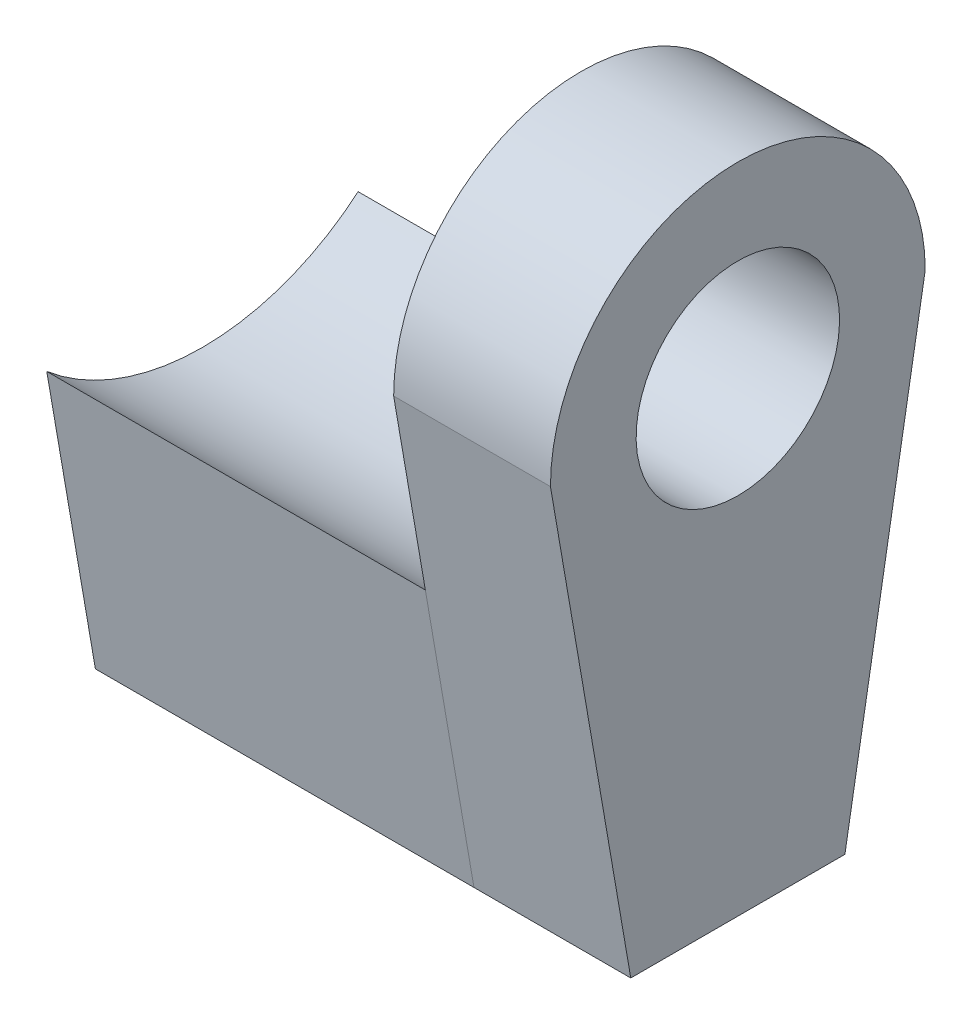
ISO-10303-21;
HEADER;
FILE_DESCRIPTION(('STEP AP214'),'2;1');
FILE_NAME('part.step','',(''),(''),'','','');
FILE_SCHEMA(('AUTOMOTIVE_DESIGN { 1 0 10303 214 1 1 1 1 }'));
ENDSEC;
DATA;
#1=APPLICATION_CONTEXT('core data for automotive mechanical design processes');
#2=APPLICATION_PROTOCOL_DEFINITION('international standard','automotive_design',2000,#1);
#3=PRODUCT_CONTEXT('',#1,'mechanical');
#4=PRODUCT('Part','Part','',(#3));
#5=PRODUCT_RELATED_PRODUCT_CATEGORY('part','',(#4));
#6=PRODUCT_DEFINITION_FORMATION('','',#4);
#7=PRODUCT_DEFINITION_CONTEXT('part definition',#1,'design');
#8=PRODUCT_DEFINITION('design','',#6,#7);
#9=PRODUCT_DEFINITION_SHAPE('','',#8);
#10=(LENGTH_UNIT() NAMED_UNIT(*) SI_UNIT(.MILLI.,.METRE.));
#11=(NAMED_UNIT(*) PLANE_ANGLE_UNIT() SI_UNIT($,.RADIAN.));
#12=(NAMED_UNIT(*) SI_UNIT($,.STERADIAN.) SOLID_ANGLE_UNIT());
#13=UNCERTAINTY_MEASURE_WITH_UNIT(LENGTH_MEASURE(1.E-05),#10,'distance_accuracy_value','');
#14=(GEOMETRIC_REPRESENTATION_CONTEXT(3) GLOBAL_UNCERTAINTY_ASSIGNED_CONTEXT((#13)) GLOBAL_UNIT_ASSIGNED_CONTEXT((#10,
#11,#12)) REPRESENTATION_CONTEXT('',''));
#15=CARTESIAN_POINT('',(0.,0.,0.));
#16=DIRECTION('',(0.,0.,1.));
#17=DIRECTION('',(1.,0.,0.));
#18=AXIS2_PLACEMENT_3D('',#15,#16,#17);
#19=CARTESIAN_POINT('',(76.,0.,0.));
#20=DIRECTION('',(-1.,0.,0.));
#21=DIRECTION('',(0.,0.,1.));
#22=AXIS2_PLACEMENT_3D('',#19,#20,#21);
#23=PLANE('',#22);
#24=CARTESIAN_POINT('',(76.,0.,0.));
#25=DIRECTION('',(-1.,0.,0.));
#26=DIRECTION('',(0.,0.,1.));
#27=AXIS2_PLACEMENT_3D('',#24,#25,#26);
#28=CIRCLE('',#27,1.9);
#29=CARTESIAN_POINT('',(76.,0.,1.9));
#30=VERTEX_POINT('',#29);
#31=EDGE_CURVE('E95',#30,#30,#28,.T.);
#32=ORIENTED_EDGE('',*,*,#31,.F.);
#33=EDGE_LOOP('',(#32));
#34=FACE_BOUND('',#33,.T.);
#35=CARTESIAN_POINT('',(76.,0.,0.));
#36=DIRECTION('',(1.,0.,0.));
#37=DIRECTION('',(0.,0.,1.));
#38=AXIS2_PLACEMENT_3D('',#35,#36,#37);
#39=CIRCLE('',#38,3.5);
#40=CARTESIAN_POINT('',(76.,0.,-3.5));
#41=VERTEX_POINT('',#40);
#42=CARTESIAN_POINT('',(76.,0.,3.5));
#43=VERTEX_POINT('',#42);
#44=EDGE_CURVE('E110',#41,#43,#39,.T.);
#45=ORIENTED_EDGE('',*,*,#44,.F.);
#46=DIRECTION('',(0.,0.985460115744348,-0.169906916507647));
#47=VECTOR('',#46,1.);
#48=CARTESIAN_POINT('',(76.,-8.69999999999998,-2.));
#49=LINE('',#48,#47);
#50=CARTESIAN_POINT('',(76.,-8.69999999999998,-2.));
#51=VERTEX_POINT('',#50);
#52=EDGE_CURVE('E100',#51,#41,#49,.T.);
#53=ORIENTED_EDGE('',*,*,#52,.F.);
#54=DIRECTION('',(0.,0.,-1.));
#55=VECTOR('',#54,1.);
#56=CARTESIAN_POINT('',(76.,-8.69999999999998,2.));
#57=LINE('',#56,#55);
#58=CARTESIAN_POINT('',(76.,-8.69999999999998,2.));
#59=VERTEX_POINT('',#58);
#60=EDGE_CURVE('E105',#59,#51,#57,.T.);
#61=ORIENTED_EDGE('',*,*,#60,.F.);
#62=DIRECTION('',(0.,-0.985460115744348,-0.169906916507647));
#63=VECTOR('',#62,1.);
#64=CARTESIAN_POINT('',(76.,0.,3.5));
#65=LINE('',#64,#63);
#66=EDGE_CURVE('E113',#43,#59,#65,.T.);
#67=ORIENTED_EDGE('',*,*,#66,.F.);
#68=EDGE_LOOP('',(#45,#53,#61,#67));
#69=FACE_BOUND('',#68,.T.);
#70=ADVANCED_FACE('F46',(#34,#69),#23,.T.);
#71=CARTESIAN_POINT('',(101.,0.,0.));
#72=DIRECTION('',(-1.,0.,0.));
#73=DIRECTION('',(0.,0.,1.));
#74=AXIS2_PLACEMENT_3D('',#71,#72,#73);
#75=CYLINDRICAL_SURFACE('',#74,3.5);
#76=DIRECTION('',(-1.,0.,0.));
#77=VECTOR('',#76,1.);
#78=CARTESIAN_POINT('',(101.,0.,3.5));
#79=LINE('',#78,#77);
#80=CARTESIAN_POINT('',(78.9288878816876,0.,3.5));
#81=VERTEX_POINT('',#80);
#82=EDGE_CURVE('E12',#81,#43,#79,.T.);
#83=ORIENTED_EDGE('',*,*,#82,.F.);
#84=CARTESIAN_POINT('',(78.9288878816876,0.,0.));
#85=DIRECTION('',(-1.,0.,0.));
#86=DIRECTION('',(0.,-1.,0.));
#87=AXIS2_PLACEMENT_3D('',#84,#85,#86);
#88=CIRCLE('',#87,3.5);
#89=CARTESIAN_POINT('',(78.9288878816876,0.,-3.5));
#90=VERTEX_POINT('',#89);
#91=EDGE_CURVE('E89',#81,#90,#88,.T.);
#92=ORIENTED_EDGE('',*,*,#91,.T.);
#93=DIRECTION('',(-1.,0.,0.));
#94=VECTOR('',#93,1.);
#95=CARTESIAN_POINT('',(101.,0.,-3.5));
#96=LINE('',#95,#94);
#97=EDGE_CURVE('E71',#90,#41,#96,.T.);
#98=ORIENTED_EDGE('',*,*,#97,.T.);
#99=ORIENTED_EDGE('',*,*,#44,.T.);
#100=EDGE_LOOP('',(#83,#92,#98,#99));
#101=FACE_BOUND('',#100,.T.);
#102=ADVANCED_FACE('F48',(#101),#75,.T.);
#103=CARTESIAN_POINT('',(101.,0.,3.5));
#104=DIRECTION('',(0.,0.169906916507647,-0.985460115744348));
#105=DIRECTION('',(0.,0.985460115744348,0.169906916507647));
#106=AXIS2_PLACEMENT_3D('',#103,#104,#105);
#107=PLANE('',#106);
#108=DIRECTION('',(-1.,0.,0.));
#109=VECTOR('',#108,1.);
#110=CARTESIAN_POINT('',(101.,-8.69999999999998,2.));
#111=LINE('',#110,#109);
#112=CARTESIAN_POINT('',(78.9288878816876,-8.69999999999998,2.));
#113=VERTEX_POINT('',#112);
#114=EDGE_CURVE('E55',#113,#59,#111,.T.);
#115=ORIENTED_EDGE('',*,*,#114,.F.);
#116=DIRECTION('',(0.,0.985460115744348,0.169906916507647));
#117=VECTOR('',#116,1.);
#118=CARTESIAN_POINT('',(78.9288878816876,0.,3.5));
#119=LINE('',#118,#117);
#120=EDGE_CURVE('E96',#113,#81,#119,.T.);
#121=ORIENTED_EDGE('',*,*,#120,.T.);
#122=ORIENTED_EDGE('',*,*,#82,.T.);
#123=ORIENTED_EDGE('',*,*,#66,.T.);
#124=EDGE_LOOP('',(#115,#121,#122,#123));
#125=FACE_BOUND('',#124,.T.);
#126=ADVANCED_FACE('F126',(#125),#107,.F.);
#127=CARTESIAN_POINT('',(101.,-8.69999999999998,2.));
#128=DIRECTION('',(0.,1.,0.));
#129=DIRECTION('',(0.,0.,1.));
#130=AXIS2_PLACEMENT_3D('',#127,#128,#129);
#131=PLANE('',#130);
#132=DIRECTION('',(-1.,0.,0.));
#133=VECTOR('',#132,1.);
#134=CARTESIAN_POINT('',(101.,-8.69999999999998,-2.));
#135=LINE('',#134,#133);
#136=CARTESIAN_POINT('',(78.9288878816876,-8.69999999999998,-2.));
#137=VERTEX_POINT('',#136);
#138=EDGE_CURVE('E102',#137,#51,#135,.T.);
#139=ORIENTED_EDGE('',*,*,#138,.F.);
#140=DIRECTION('',(0.,0.,1.));
#141=VECTOR('',#140,1.);
#142=CARTESIAN_POINT('',(78.9288878816876,-8.69999999999998,2.));
#143=LINE('',#142,#141);
#144=EDGE_CURVE('E63',#137,#113,#143,.T.);
#145=ORIENTED_EDGE('',*,*,#144,.T.);
#146=ORIENTED_EDGE('',*,*,#114,.T.);
#147=ORIENTED_EDGE('',*,*,#60,.T.);
#148=EDGE_LOOP('',(#139,#145,#146,#147));
#149=FACE_BOUND('',#148,.T.);
#150=ADVANCED_FACE('F121',(#149),#131,.F.);
#151=CARTESIAN_POINT('',(101.,-8.69999999999998,-2.));
#152=DIRECTION('',(0.,0.169906916507647,0.985460115744348));
#153=DIRECTION('',(0.,-0.985460115744348,0.169906916507647));
#154=AXIS2_PLACEMENT_3D('',#151,#152,#153);
#155=PLANE('',#154);
#156=ORIENTED_EDGE('',*,*,#97,.F.);
#157=DIRECTION('',(0.,-0.985460115744348,0.169906916507647));
#158=VECTOR('',#157,1.);
#159=CARTESIAN_POINT('',(78.9288878816876,-8.69999999999996,-2.));
#160=LINE('',#159,#158);
#161=EDGE_CURVE('E87',#90,#137,#160,.T.);
#162=ORIENTED_EDGE('',*,*,#161,.T.);
#163=ORIENTED_EDGE('',*,*,#138,.T.);
#164=ORIENTED_EDGE('',*,*,#52,.T.);
#165=EDGE_LOOP('',(#156,#162,#163,#164));
#166=FACE_BOUND('',#165,.T.);
#167=ADVANCED_FACE('F98',(#166),#155,.F.);
#168=CARTESIAN_POINT('',(0.,0.,0.));
#169=DIRECTION('',(1.,0.,0.));
#170=DIRECTION('',(0.,0.,-1.));
#171=AXIS2_PLACEMENT_3D('',#168,#169,#170);
#172=CYLINDRICAL_SURFACE('',#171,1.9);
#173=CARTESIAN_POINT('',(78.9288878816876,0.,0.));
#174=DIRECTION('',(-1.,0.,0.));
#175=DIRECTION('',(0.,-1.,0.));
#176=AXIS2_PLACEMENT_3D('',#173,#174,#175);
#177=CIRCLE('',#176,1.9);
#178=CARTESIAN_POINT('',(78.9288878816876,-1.9,0.));
#179=VERTEX_POINT('',#178);
#180=EDGE_CURVE('E50',#179,#179,#177,.F.);
#181=ORIENTED_EDGE('',*,*,#180,.T.);
#182=EDGE_LOOP('',(#181));
#183=FACE_BOUND('',#182,.T.);
#184=ORIENTED_EDGE('',*,*,#31,.T.);
#185=EDGE_LOOP('',(#184));
#186=FACE_BOUND('',#185,.T.);
#187=ADVANCED_FACE('F141',(#183,#186),#172,.F.);
#188=CARTESIAN_POINT('',(78.9288878816876,0.,0.));
#189=DIRECTION('',(-1.,0.,0.));
#190=DIRECTION('',(0.,-1.,0.));
#191=AXIS2_PLACEMENT_3D('',#188,#189,#190);
#192=PLANE('',#191);
#193=ORIENTED_EDGE('',*,*,#180,.F.);
#194=EDGE_LOOP('',(#193));
#195=FACE_BOUND('',#194,.T.);
#196=ORIENTED_EDGE('',*,*,#120,.F.);
#197=ORIENTED_EDGE('',*,*,#144,.F.);
#198=ORIENTED_EDGE('',*,*,#161,.F.);
#199=ORIENTED_EDGE('',*,*,#91,.F.);
#200=EDGE_LOOP('',(#196,#197,#198,#199));
#201=FACE_BOUND('',#200,.T.);
#202=ADVANCED_FACE('F88',(#195,#201),#192,.F.);
#203=CLOSED_SHELL('',(#70,#102,#126,#150,#167,#187,#202));
#204=MANIFOLD_SOLID_BREP('B2',#203);
#205=CARTESIAN_POINT('',(25.,-8.69999999999998,2.));
#206=DIRECTION('',(0.,1.,0.));
#207=DIRECTION('',(0.,0.,1.));
#208=AXIS2_PLACEMENT_3D('',#205,#206,#207);
#209=PLANE('',#208);
#210=DIRECTION('',(0.,0.,1.));
#211=VECTOR('',#210,1.);
#212=CARTESIAN_POINT('',(68.9288878816876,-8.69999999999998,2.));
#213=LINE('',#212,#211);
#214=CARTESIAN_POINT('',(68.9288878816876,-8.69999999999998,-2.));
#215=VERTEX_POINT('',#214);
#216=CARTESIAN_POINT('',(68.9288878816876,-8.69999999999998,2.));
#217=VERTEX_POINT('',#216);
#218=EDGE_CURVE('E255',#215,#217,#213,.T.);
#219=ORIENTED_EDGE('',*,*,#218,.F.);
#220=DIRECTION('',(-1.,0.,0.));
#221=VECTOR('',#220,1.);
#222=CARTESIAN_POINT('',(25.,-8.69999999999998,-2.));
#223=LINE('',#222,#221);
#224=CARTESIAN_POINT('',(76.,-8.69999999999998,-2.));
#225=VERTEX_POINT('',#224);
#226=EDGE_CURVE('E212',#225,#215,#223,.T.);
#227=ORIENTED_EDGE('',*,*,#226,.F.);
#228=DIRECTION('',(0.,0.,-1.));
#229=VECTOR('',#228,1.);
#230=CARTESIAN_POINT('',(76.,-8.69999999999998,2.));
#231=LINE('',#230,#229);
#232=CARTESIAN_POINT('',(76.,-8.69999999999998,2.));
#233=VERTEX_POINT('',#232);
#234=EDGE_CURVE('E268',#233,#225,#231,.T.);
#235=ORIENTED_EDGE('',*,*,#234,.F.);
#236=DIRECTION('',(-1.,0.,0.));
#237=VECTOR('',#236,1.);
#238=CARTESIAN_POINT('',(25.,-8.69999999999998,2.));
#239=LINE('',#238,#237);
#240=EDGE_CURVE('E258',#233,#217,#239,.T.);
#241=ORIENTED_EDGE('',*,*,#240,.T.);
#242=EDGE_LOOP('',(#219,#227,#235,#241));
#243=FACE_BOUND('',#242,.T.);
#244=ADVANCED_FACE('F205',(#243),#209,.F.);
#245=CARTESIAN_POINT('',(25.,-8.69999999999998,-2.));
#246=DIRECTION('',(0.,0.169906916507647,0.985460115744348));
#247=DIRECTION('',(0.,-0.985460115744348,0.169906916507647));
#248=AXIS2_PLACEMENT_3D('',#245,#246,#247);
#249=PLANE('',#248);
#250=DIRECTION('',(0.,-0.985460115744348,0.169906916507647));
#251=VECTOR('',#250,1.);
#252=CARTESIAN_POINT('',(68.9288878816876,-8.70000000000002,-1.99999999999999));
#253=LINE('',#252,#251);
#254=CARTESIAN_POINT('',(68.9288878816876,-3.43426955710062,-2.90788455912058));
#255=VERTEX_POINT('',#254);
#256=EDGE_CURVE('E244',#255,#215,#253,.T.);
#257=ORIENTED_EDGE('',*,*,#256,.F.);
#258=DIRECTION('',(-1.,0.,0.));
#259=VECTOR('',#258,1.);
#260=CARTESIAN_POINT('',(76.,-3.43426955710062,-2.90788455912058));
#261=LINE('',#260,#259);
#262=CARTESIAN_POINT('',(76.,-3.43426955710062,-2.90788455912058));
#263=VERTEX_POINT('',#262);
#264=EDGE_CURVE('E254',#263,#255,#261,.T.);
#265=ORIENTED_EDGE('',*,*,#264,.F.);
#266=DIRECTION('',(0.,0.985460115744348,-0.169906916507647));
#267=VECTOR('',#266,1.);
#268=CARTESIAN_POINT('',(76.,-8.69999999999998,-2.));
#269=LINE('',#268,#267);
#270=EDGE_CURVE('E266',#225,#263,#269,.T.);
#271=ORIENTED_EDGE('',*,*,#270,.F.);
#272=ORIENTED_EDGE('',*,*,#226,.T.);
#273=EDGE_LOOP('',(#257,#265,#271,#272));
#274=FACE_BOUND('',#273,.T.);
#275=ADVANCED_FACE('F252',(#274),#249,.F.);
#276=CARTESIAN_POINT('',(25.,0.,3.5));
#277=DIRECTION('',(0.,0.169906916507647,-0.985460115744348));
#278=DIRECTION('',(0.,0.985460115744348,0.169906916507647));
#279=AXIS2_PLACEMENT_3D('',#276,#277,#278);
#280=PLANE('',#279);
#281=DIRECTION('',(0.,0.985460115744348,0.169906916507647));
#282=VECTOR('',#281,1.);
#283=CARTESIAN_POINT('',(68.9288878816876,0.,3.49999999999999));
#284=LINE('',#283,#282);
#285=CARTESIAN_POINT('',(68.9288878816876,-3.43426955710062,2.90788455912058));
#286=VERTEX_POINT('',#285);
#287=EDGE_CURVE('E218',#217,#286,#284,.T.);
#288=ORIENTED_EDGE('',*,*,#287,.F.);
#289=ORIENTED_EDGE('',*,*,#240,.F.);
#290=DIRECTION('',(0.,-0.985460115744348,-0.169906916507647));
#291=VECTOR('',#290,1.);
#292=CARTESIAN_POINT('',(76.,-3.43426955710062,2.90788455912058));
#293=LINE('',#292,#291);
#294=CARTESIAN_POINT('',(76.,-3.43426955710062,2.90788455912058));
#295=VERTEX_POINT('',#294);
#296=EDGE_CURVE('E271',#295,#233,#293,.T.);
#297=ORIENTED_EDGE('',*,*,#296,.F.);
#298=DIRECTION('',(-1.,0.,0.));
#299=VECTOR('',#298,1.);
#300=CARTESIAN_POINT('',(76.,-3.43426955710062,2.90788455912058));
#301=LINE('',#300,#299);
#302=EDGE_CURVE('E259',#295,#286,#301,.T.);
#303=ORIENTED_EDGE('',*,*,#302,.T.);
#304=EDGE_LOOP('',(#288,#289,#297,#303));
#305=FACE_BOUND('',#304,.T.);
#306=ADVANCED_FACE('F276',(#305),#280,.F.);
#307=CARTESIAN_POINT('',(76.,0.,0.));
#308=DIRECTION('',(-1.,0.,0.));
#309=DIRECTION('',(0.,0.,1.));
#310=AXIS2_PLACEMENT_3D('',#307,#308,#309);
#311=CYLINDRICAL_SURFACE('',#310,4.5);
#312=CARTESIAN_POINT('',(68.9288878816876,0.,0.));
#313=DIRECTION('',(-1.,0.,0.));
#314=DIRECTION('',(0.,-1.,0.));
#315=AXIS2_PLACEMENT_3D('',#312,#313,#314);
#316=CIRCLE('',#315,4.5);
#317=EDGE_CURVE('E44',#286,#255,#316,.F.);
#318=ORIENTED_EDGE('',*,*,#317,.F.);
#319=ORIENTED_EDGE('',*,*,#302,.F.);
#320=CARTESIAN_POINT('',(76.,0.,0.));
#321=DIRECTION('',(-1.,0.,0.));
#322=DIRECTION('',(0.,0.,-1.));
#323=AXIS2_PLACEMENT_3D('',#320,#321,#322);
#324=CIRCLE('',#323,4.5);
#325=EDGE_CURVE('E226',#263,#295,#324,.T.);
#326=ORIENTED_EDGE('',*,*,#325,.F.);
#327=ORIENTED_EDGE('',*,*,#264,.T.);
#328=EDGE_LOOP('',(#318,#319,#326,#327));
#329=FACE_BOUND('',#328,.T.);
#330=ADVANCED_FACE('F257',(#329),#311,.F.);
#331=CARTESIAN_POINT('',(76.,0.,0.));
#332=DIRECTION('',(1.,0.,0.));
#333=DIRECTION('',(0.,0.,-1.));
#334=AXIS2_PLACEMENT_3D('',#331,#332,#333);
#335=PLANE('',#334);
#336=ORIENTED_EDGE('',*,*,#296,.T.);
#337=ORIENTED_EDGE('',*,*,#234,.T.);
#338=ORIENTED_EDGE('',*,*,#270,.T.);
#339=ORIENTED_EDGE('',*,*,#325,.T.);
#340=EDGE_LOOP('',(#336,#337,#338,#339));
#341=FACE_BOUND('',#340,.T.);
#342=ADVANCED_FACE('F279',(#341),#335,.T.);
#343=CARTESIAN_POINT('',(68.9288878816876,0.,0.));
#344=DIRECTION('',(-1.,0.,0.));
#345=DIRECTION('',(0.,-1.,0.));
#346=AXIS2_PLACEMENT_3D('',#343,#344,#345);
#347=PLANE('',#346);
#348=ORIENTED_EDGE('',*,*,#218,.T.);
#349=ORIENTED_EDGE('',*,*,#287,.T.);
#350=ORIENTED_EDGE('',*,*,#317,.T.);
#351=ORIENTED_EDGE('',*,*,#256,.T.);
#352=EDGE_LOOP('',(#348,#349,#350,#351));
#353=FACE_BOUND('',#352,.T.);
#354=ADVANCED_FACE('F243',(#353),#347,.T.);
#355=CLOSED_SHELL('',(#244,#275,#306,#330,#342,#354));
#356=MANIFOLD_SOLID_BREP('B6',#355);
#357=ADVANCED_BREP_SHAPE_REPRESENTATION('',(#18,#204,#356),#14);
#358=SHAPE_DEFINITION_REPRESENTATION(#9,#357);
ENDSEC;
END-ISO-10303-21;
